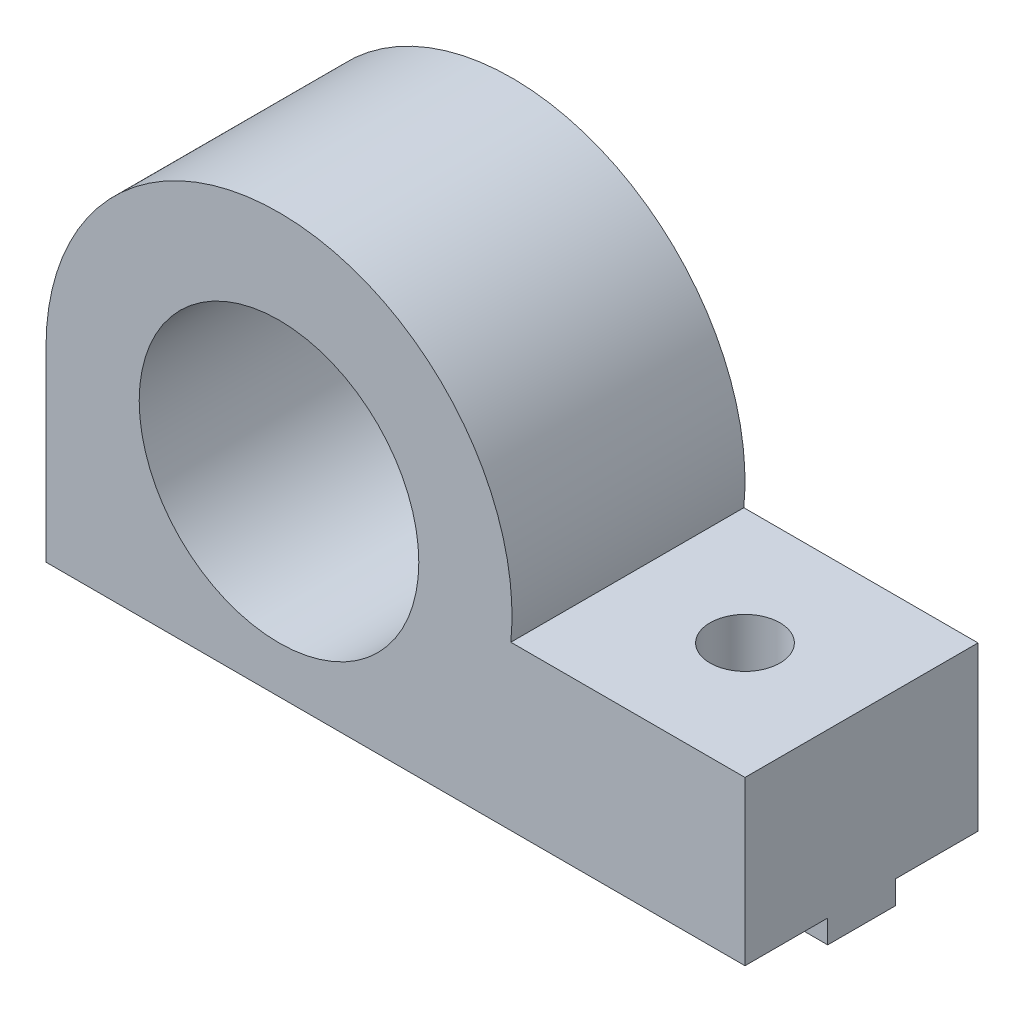
ISO-10303-21;
HEADER;
FILE_DESCRIPTION(('STEP AP214'),'2;1');
FILE_NAME('part.step','',(''),(''),'','','');
FILE_SCHEMA(('AUTOMOTIVE_DESIGN { 1 0 10303 214 1 1 1 1 }'));
ENDSEC;
DATA;
#1=APPLICATION_CONTEXT('core data for automotive mechanical design processes');
#2=APPLICATION_PROTOCOL_DEFINITION('international standard','automotive_design',2000,#1);
#3=PRODUCT_CONTEXT('',#1,'mechanical');
#4=PRODUCT('Part','Part','',(#3));
#5=PRODUCT_RELATED_PRODUCT_CATEGORY('part','',(#4));
#6=PRODUCT_DEFINITION_FORMATION('','',#4);
#7=PRODUCT_DEFINITION_CONTEXT('part definition',#1,'design');
#8=PRODUCT_DEFINITION('design','',#6,#7);
#9=PRODUCT_DEFINITION_SHAPE('','',#8);
#10=(LENGTH_UNIT() NAMED_UNIT(*) SI_UNIT(.MILLI.,.METRE.));
#11=(NAMED_UNIT(*) PLANE_ANGLE_UNIT() SI_UNIT($,.RADIAN.));
#12=(NAMED_UNIT(*) SI_UNIT($,.STERADIAN.) SOLID_ANGLE_UNIT());
#13=UNCERTAINTY_MEASURE_WITH_UNIT(LENGTH_MEASURE(1.E-05),#10,'distance_accuracy_value','');
#14=(GEOMETRIC_REPRESENTATION_CONTEXT(3) GLOBAL_UNCERTAINTY_ASSIGNED_CONTEXT((#13)) GLOBAL_UNIT_ASSIGNED_CONTEXT((#10,
#11,#12)) REPRESENTATION_CONTEXT('',''));
#15=CARTESIAN_POINT('',(0.,0.,0.));
#16=DIRECTION('',(0.,0.,1.));
#17=DIRECTION('',(1.,0.,0.));
#18=AXIS2_PLACEMENT_3D('',#15,#16,#17);
#19=CARTESIAN_POINT('',(-10.,-9.,3.55));
#20=DIRECTION('',(0.,0.,1.));
#21=DIRECTION('',(1.,0.,0.));
#22=AXIS2_PLACEMENT_3D('',#19,#20,#21);
#23=PLANE('',#22);
#24=DIRECTION('',(1.,0.,0.));
#25=VECTOR('',#24,1.);
#26=CARTESIAN_POINT('',(-10.,-9.,3.55));
#27=LINE('',#26,#25);
#28=CARTESIAN_POINT('',(15.3840572873934,-9.,3.55));
#29=VERTEX_POINT('',#28);
#30=CARTESIAN_POINT('',(20.,-9.,3.55));
#31=VERTEX_POINT('',#30);
#32=EDGE_CURVE('E231',#29,#31,#27,.T.);
#33=ORIENTED_EDGE('',*,*,#32,.F.);
#34=DIRECTION('',(0.,1.,0.));
#35=VECTOR('',#34,1.);
#36=CARTESIAN_POINT('',(15.3840572873934,-9.,3.55));
#37=LINE('',#36,#35);
#38=CARTESIAN_POINT('',(15.3840572873934,-8.,3.55));
#39=VERTEX_POINT('',#38);
#40=EDGE_CURVE('E131',#29,#39,#37,.T.);
#41=ORIENTED_EDGE('',*,*,#40,.T.);
#42=DIRECTION('',(1.,0.,0.));
#43=VECTOR('',#42,1.);
#44=CARTESIAN_POINT('',(-10.,-8.,3.55));
#45=LINE('',#44,#43);
#46=CARTESIAN_POINT('',(20.,-8.,3.55));
#47=VERTEX_POINT('',#46);
#48=EDGE_CURVE('E160',#39,#47,#45,.T.);
#49=ORIENTED_EDGE('',*,*,#48,.T.);
#50=DIRECTION('',(0.,1.,0.));
#51=VECTOR('',#50,1.);
#52=CARTESIAN_POINT('',(20.,-9.,3.55));
#53=LINE('',#52,#51);
#54=EDGE_CURVE('E164',#31,#47,#53,.T.);
#55=ORIENTED_EDGE('',*,*,#54,.F.);
#56=EDGE_LOOP('',(#33,#41,#49,#55));
#57=FACE_BOUND('',#56,.T.);
#58=ADVANCED_FACE('F33',(#57),#23,.F.);
#59=CARTESIAN_POINT('',(-10.,-9.,6.45));
#60=DIRECTION('',(0.,0.,-1.));
#61=DIRECTION('',(-1.,0.,0.));
#62=AXIS2_PLACEMENT_3D('',#59,#60,#61);
#63=PLANE('',#62);
#64=DIRECTION('',(-1.,0.,0.));
#65=VECTOR('',#64,1.);
#66=CARTESIAN_POINT('',(-10.,-9.,6.45));
#67=LINE('',#66,#65);
#68=CARTESIAN_POINT('',(14.6159427126066,-9.,6.45));
#69=VERTEX_POINT('',#68);
#70=CARTESIAN_POINT('',(-10.,-9.,6.45));
#71=VERTEX_POINT('',#70);
#72=EDGE_CURVE('E150',#69,#71,#67,.T.);
#73=ORIENTED_EDGE('',*,*,#72,.F.);
#74=DIRECTION('',(0.,1.,0.));
#75=VECTOR('',#74,1.);
#76=CARTESIAN_POINT('',(14.6159427126066,-9.,6.45));
#77=LINE('',#76,#75);
#78=CARTESIAN_POINT('',(14.6159427126066,-8.,6.45));
#79=VERTEX_POINT('',#78);
#80=EDGE_CURVE('E48',#69,#79,#77,.T.);
#81=ORIENTED_EDGE('',*,*,#80,.T.);
#82=DIRECTION('',(-1.,0.,0.));
#83=VECTOR('',#82,1.);
#84=CARTESIAN_POINT('',(-10.,-8.,6.45));
#85=LINE('',#84,#83);
#86=CARTESIAN_POINT('',(-10.,-8.,6.45));
#87=VERTEX_POINT('',#86);
#88=EDGE_CURVE('E159',#79,#87,#85,.T.);
#89=ORIENTED_EDGE('',*,*,#88,.T.);
#90=DIRECTION('',(0.,1.,0.));
#91=VECTOR('',#90,1.);
#92=CARTESIAN_POINT('',(-10.,-9.,6.45));
#93=LINE('',#92,#91);
#94=EDGE_CURVE('E149',#71,#87,#93,.T.);
#95=ORIENTED_EDGE('',*,*,#94,.F.);
#96=EDGE_LOOP('',(#73,#81,#89,#95));
#97=FACE_BOUND('',#96,.T.);
#98=ADVANCED_FACE('F273',(#97),#63,.F.);
#99=CARTESIAN_POINT('',(0.,-9.,0.));
#100=DIRECTION('',(0.,-1.,0.));
#101=DIRECTION('',(0.,0.,-1.));
#102=AXIS2_PLACEMENT_3D('',#99,#100,#101);
#103=PLANE('',#102);
#104=CARTESIAN_POINT('',(15.,-9.,5.));
#105=DIRECTION('',(0.,-1.,0.));
#106=DIRECTION('',(0.,0.,-1.));
#107=AXIS2_PLACEMENT_3D('',#104,#105,#106);
#108=CIRCLE('',#107,1.5);
#109=CARTESIAN_POINT('',(15.3840572873934,-9.,6.45));
#110=VERTEX_POINT('',#109);
#111=EDGE_CURVE('E11',#29,#110,#108,.T.);
#112=ORIENTED_EDGE('',*,*,#111,.F.);
#113=ORIENTED_EDGE('',*,*,#32,.T.);
#114=DIRECTION('',(0.,0.,1.));
#115=VECTOR('',#114,1.);
#116=CARTESIAN_POINT('',(20.,-9.,6.45));
#117=LINE('',#116,#115);
#118=CARTESIAN_POINT('',(20.,-9.,6.45));
#119=VERTEX_POINT('',#118);
#120=EDGE_CURVE('E147',#31,#119,#117,.T.);
#121=ORIENTED_EDGE('',*,*,#120,.T.);
#122=EDGE_CURVE('E140',#119,#110,#67,.T.);
#123=ORIENTED_EDGE('',*,*,#122,.T.);
#124=EDGE_LOOP('',(#112,#113,#121,#123));
#125=FACE_BOUND('',#124,.T.);
#126=ADVANCED_FACE('F145',(#125),#103,.T.);
#127=CARTESIAN_POINT('',(-10.,-8.,10.));
#128=DIRECTION('',(0.,1.,0.));
#129=DIRECTION('',(0.,0.,1.));
#130=AXIS2_PLACEMENT_3D('',#127,#128,#129);
#131=PLANE('',#130);
#132=ORIENTED_EDGE('',*,*,#88,.F.);
#133=CARTESIAN_POINT('',(15.,-8.,5.));
#134=DIRECTION('',(0.,1.,0.));
#135=DIRECTION('',(0.,0.,1.));
#136=AXIS2_PLACEMENT_3D('',#133,#134,#135);
#137=CIRCLE('',#136,1.5);
#138=CARTESIAN_POINT('',(15.3840572873934,-8.,6.45));
#139=VERTEX_POINT('',#138);
#140=EDGE_CURVE('E142',#79,#139,#137,.T.);
#141=ORIENTED_EDGE('',*,*,#140,.T.);
#142=CARTESIAN_POINT('',(20.,-8.,6.45));
#143=VERTEX_POINT('',#142);
#144=EDGE_CURVE('E141',#143,#139,#85,.T.);
#145=ORIENTED_EDGE('',*,*,#144,.F.);
#146=DIRECTION('',(0.,0.,-1.));
#147=VECTOR('',#146,1.);
#148=CARTESIAN_POINT('',(20.,-8.,10.));
#149=LINE('',#148,#147);
#150=CARTESIAN_POINT('',(20.,-8.,10.));
#151=VERTEX_POINT('',#150);
#152=EDGE_CURVE('E204',#151,#143,#149,.T.);
#153=ORIENTED_EDGE('',*,*,#152,.F.);
#154=DIRECTION('',(1.,0.,0.));
#155=VECTOR('',#154,1.);
#156=CARTESIAN_POINT('',(-10.,-8.,10.));
#157=LINE('',#156,#155);
#158=CARTESIAN_POINT('',(-10.,-8.,10.));
#159=VERTEX_POINT('',#158);
#160=EDGE_CURVE('E185',#159,#151,#157,.T.);
#161=ORIENTED_EDGE('',*,*,#160,.F.);
#162=DIRECTION('',(0.,0.,-1.));
#163=VECTOR('',#162,1.);
#164=CARTESIAN_POINT('',(-10.,-8.,10.));
#165=LINE('',#164,#163);
#166=EDGE_CURVE('E208',#159,#87,#165,.T.);
#167=ORIENTED_EDGE('',*,*,#166,.T.);
#168=EDGE_LOOP('',(#132,#141,#145,#153,#161,#167));
#169=FACE_BOUND('',#168,.T.);
#170=ADVANCED_FACE('F276',(#169),#131,.F.);
#171=ORIENTED_EDGE('',*,*,#48,.F.);
#172=CARTESIAN_POINT('',(15.,-8.,5.));
#173=DIRECTION('',(0.,1.,0.));
#174=DIRECTION('',(0.,0.,1.));
#175=AXIS2_PLACEMENT_3D('',#172,#173,#174);
#176=CIRCLE('',#175,1.5);
#177=CARTESIAN_POINT('',(14.6159427126066,-8.,3.55));
#178=VERTEX_POINT('',#177);
#179=EDGE_CURVE('E226',#39,#178,#176,.T.);
#180=ORIENTED_EDGE('',*,*,#179,.T.);
#181=CARTESIAN_POINT('',(-10.,-8.,3.55));
#182=VERTEX_POINT('',#181);
#183=EDGE_CURVE('E56',#182,#178,#45,.T.);
#184=ORIENTED_EDGE('',*,*,#183,.F.);
#185=CARTESIAN_POINT('',(-10.,-8.,0.));
#186=VERTEX_POINT('',#185);
#187=EDGE_CURVE('E207',#182,#186,#165,.T.);
#188=ORIENTED_EDGE('',*,*,#187,.T.);
#189=DIRECTION('',(1.,0.,0.));
#190=VECTOR('',#189,1.);
#191=CARTESIAN_POINT('',(-10.,-8.,0.));
#192=LINE('',#191,#190);
#193=CARTESIAN_POINT('',(20.,-8.,0.));
#194=VERTEX_POINT('',#193);
#195=EDGE_CURVE('E197',#186,#194,#192,.T.);
#196=ORIENTED_EDGE('',*,*,#195,.T.);
#197=EDGE_CURVE('E203',#47,#194,#149,.T.);
#198=ORIENTED_EDGE('',*,*,#197,.F.);
#199=EDGE_LOOP('',(#171,#180,#184,#188,#196,#198));
#200=FACE_BOUND('',#199,.T.);
#201=ADVANCED_FACE('F270',(#200),#131,.F.);
#202=CARTESIAN_POINT('',(0.,0.,10.));
#203=DIRECTION('',(0.,0.,-1.));
#204=DIRECTION('',(-1.,0.,0.));
#205=AXIS2_PLACEMENT_3D('',#202,#203,#204);
#206=PLANE('',#205);
#207=DIRECTION('',(-1.,0.,0.));
#208=VECTOR('',#207,1.);
#209=CARTESIAN_POINT('',(20.,-1.,10.));
#210=LINE('',#209,#208);
#211=CARTESIAN_POINT('',(20.,-1.,10.));
#212=VERTEX_POINT('',#211);
#213=CARTESIAN_POINT('',(9.9498743710662,-0.999999999999998,10.));
#214=VERTEX_POINT('',#213);
#215=EDGE_CURVE('E177',#212,#214,#210,.T.);
#216=ORIENTED_EDGE('',*,*,#215,.T.);
#217=CARTESIAN_POINT('',(0.,0.,10.));
#218=DIRECTION('',(0.,0.,1.));
#219=DIRECTION('',(-1.,0.,0.));
#220=AXIS2_PLACEMENT_3D('',#217,#218,#219);
#221=CIRCLE('',#220,10.);
#222=CARTESIAN_POINT('',(-10.,0.,10.));
#223=VERTEX_POINT('',#222);
#224=EDGE_CURVE('E180',#214,#223,#221,.T.);
#225=ORIENTED_EDGE('',*,*,#224,.T.);
#226=DIRECTION('',(0.,-1.,0.));
#227=VECTOR('',#226,1.);
#228=CARTESIAN_POINT('',(-10.,0.,10.));
#229=LINE('',#228,#227);
#230=EDGE_CURVE('E183',#223,#159,#229,.T.);
#231=ORIENTED_EDGE('',*,*,#230,.T.);
#232=ORIENTED_EDGE('',*,*,#160,.T.);
#233=DIRECTION('',(0.,1.,0.));
#234=VECTOR('',#233,1.);
#235=CARTESIAN_POINT('',(20.,-8.,10.));
#236=LINE('',#235,#234);
#237=EDGE_CURVE('E187',#151,#212,#236,.T.);
#238=ORIENTED_EDGE('',*,*,#237,.T.);
#239=EDGE_LOOP('',(#216,#225,#231,#232,#238));
#240=FACE_BOUND('',#239,.T.);
#241=CARTESIAN_POINT('',(0.,0.,10.));
#242=DIRECTION('',(0.,0.,1.));
#243=DIRECTION('',(1.,0.,0.));
#244=AXIS2_PLACEMENT_3D('',#241,#242,#243);
#245=CIRCLE('',#244,6.);
#246=CARTESIAN_POINT('',(6.,0.,10.));
#247=VERTEX_POINT('',#246);
#248=EDGE_CURVE('E171',#247,#247,#245,.T.);
#249=ORIENTED_EDGE('',*,*,#248,.F.);
#250=EDGE_LOOP('',(#249));
#251=FACE_BOUND('',#250,.T.);
#252=ADVANCED_FACE('F261',(#240,#251),#206,.F.);
#253=CARTESIAN_POINT('',(0.,0.,0.));
#254=DIRECTION('',(0.,0.,-1.));
#255=DIRECTION('',(-1.,0.,0.));
#256=AXIS2_PLACEMENT_3D('',#253,#254,#255);
#257=PLANE('',#256);
#258=DIRECTION('',(-1.,0.,0.));
#259=VECTOR('',#258,1.);
#260=CARTESIAN_POINT('',(20.,-1.,0.));
#261=LINE('',#260,#259);
#262=CARTESIAN_POINT('',(20.,-1.,0.));
#263=VERTEX_POINT('',#262);
#264=CARTESIAN_POINT('',(9.9498743710662,-0.999999999999998,0.));
#265=VERTEX_POINT('',#264);
#266=EDGE_CURVE('E174',#263,#265,#261,.T.);
#267=ORIENTED_EDGE('',*,*,#266,.F.);
#268=DIRECTION('',(0.,1.,0.));
#269=VECTOR('',#268,1.);
#270=CARTESIAN_POINT('',(20.,-8.,0.));
#271=LINE('',#270,#269);
#272=EDGE_CURVE('E181',#194,#263,#271,.T.);
#273=ORIENTED_EDGE('',*,*,#272,.F.);
#274=ORIENTED_EDGE('',*,*,#195,.F.);
#275=DIRECTION('',(0.,-1.,0.));
#276=VECTOR('',#275,1.);
#277=CARTESIAN_POINT('',(-10.,0.,0.));
#278=LINE('',#277,#276);
#279=CARTESIAN_POINT('',(-10.,0.,0.));
#280=VERTEX_POINT('',#279);
#281=EDGE_CURVE('E194',#280,#186,#278,.T.);
#282=ORIENTED_EDGE('',*,*,#281,.F.);
#283=CARTESIAN_POINT('',(0.,0.,0.));
#284=DIRECTION('',(0.,0.,1.));
#285=DIRECTION('',(-1.,0.,0.));
#286=AXIS2_PLACEMENT_3D('',#283,#284,#285);
#287=CIRCLE('',#286,10.);
#288=EDGE_CURVE('E192',#265,#280,#287,.T.);
#289=ORIENTED_EDGE('',*,*,#288,.F.);
#290=EDGE_LOOP('',(#267,#273,#274,#282,#289));
#291=FACE_BOUND('',#290,.T.);
#292=CARTESIAN_POINT('',(0.,0.,0.));
#293=DIRECTION('',(0.,0.,1.));
#294=DIRECTION('',(1.,0.,0.));
#295=AXIS2_PLACEMENT_3D('',#292,#293,#294);
#296=CIRCLE('',#295,6.);
#297=CARTESIAN_POINT('',(6.,0.,0.));
#298=VERTEX_POINT('',#297);
#299=EDGE_CURVE('E170',#298,#298,#296,.T.);
#300=ORIENTED_EDGE('',*,*,#299,.T.);
#301=EDGE_LOOP('',(#300));
#302=FACE_BOUND('',#301,.T.);
#303=ADVANCED_FACE('F245',(#291,#302),#257,.T.);
#304=CARTESIAN_POINT('',(20.,-1.,10.));
#305=DIRECTION('',(0.,-1.,0.));
#306=DIRECTION('',(1.,0.,0.));
#307=AXIS2_PLACEMENT_3D('',#304,#305,#306);
#308=PLANE('',#307);
#309=CARTESIAN_POINT('',(15.,-1.,5.));
#310=DIRECTION('',(0.,1.,0.));
#311=DIRECTION('',(-1.,0.,0.));
#312=AXIS2_PLACEMENT_3D('',#309,#310,#311);
#313=CIRCLE('',#312,1.5);
#314=CARTESIAN_POINT('',(13.5,-1.,5.));
#315=VERTEX_POINT('',#314);
#316=EDGE_CURVE('E143',#315,#315,#313,.T.);
#317=ORIENTED_EDGE('',*,*,#316,.F.);
#318=EDGE_LOOP('',(#317));
#319=FACE_BOUND('',#318,.T.);
#320=ORIENTED_EDGE('',*,*,#266,.T.);
#321=DIRECTION('',(0.,0.,-1.));
#322=VECTOR('',#321,1.);
#323=CARTESIAN_POINT('',(9.9498743710662,-0.999999999999998,10.));
#324=LINE('',#323,#322);
#325=EDGE_CURVE('E213',#214,#265,#324,.T.);
#326=ORIENTED_EDGE('',*,*,#325,.F.);
#327=ORIENTED_EDGE('',*,*,#215,.F.);
#328=DIRECTION('',(0.,0.,-1.));
#329=VECTOR('',#328,1.);
#330=CARTESIAN_POINT('',(20.,-1.,10.));
#331=LINE('',#330,#329);
#332=EDGE_CURVE('E189',#212,#263,#331,.T.);
#333=ORIENTED_EDGE('',*,*,#332,.T.);
#334=EDGE_LOOP('',(#320,#326,#327,#333));
#335=FACE_BOUND('',#334,.T.);
#336=ADVANCED_FACE('F35',(#319,#335),#308,.F.);
#337=CARTESIAN_POINT('',(0.,0.,10.));
#338=DIRECTION('',(0.,0.,-1.));
#339=DIRECTION('',(-1.,0.,0.));
#340=AXIS2_PLACEMENT_3D('',#337,#338,#339);
#341=CYLINDRICAL_SURFACE('',#340,10.);
#342=ORIENTED_EDGE('',*,*,#288,.T.);
#343=DIRECTION('',(0.,0.,-1.));
#344=VECTOR('',#343,1.);
#345=CARTESIAN_POINT('',(-10.,0.,10.));
#346=LINE('',#345,#344);
#347=EDGE_CURVE('E211',#223,#280,#346,.T.);
#348=ORIENTED_EDGE('',*,*,#347,.F.);
#349=ORIENTED_EDGE('',*,*,#224,.F.);
#350=ORIENTED_EDGE('',*,*,#325,.T.);
#351=EDGE_LOOP('',(#342,#348,#349,#350));
#352=FACE_BOUND('',#351,.T.);
#353=ADVANCED_FACE('F244',(#352),#341,.T.);
#354=CARTESIAN_POINT('',(-10.,0.,10.));
#355=DIRECTION('',(1.,0.,0.));
#356=DIRECTION('',(0.,1.,0.));
#357=AXIS2_PLACEMENT_3D('',#354,#355,#356);
#358=PLANE('',#357);
#359=ORIENTED_EDGE('',*,*,#281,.T.);
#360=ORIENTED_EDGE('',*,*,#187,.F.);
#361=DIRECTION('',(0.,1.,0.));
#362=VECTOR('',#361,1.);
#363=CARTESIAN_POINT('',(-10.,-9.,3.55));
#364=LINE('',#363,#362);
#365=CARTESIAN_POINT('',(-10.,-9.,3.55));
#366=VERTEX_POINT('',#365);
#367=EDGE_CURVE('E167',#366,#182,#364,.T.);
#368=ORIENTED_EDGE('',*,*,#367,.F.);
#369=DIRECTION('',(0.,0.,-1.));
#370=VECTOR('',#369,1.);
#371=CARTESIAN_POINT('',(-10.,-9.,6.45));
#372=LINE('',#371,#370);
#373=EDGE_CURVE('E161',#71,#366,#372,.T.);
#374=ORIENTED_EDGE('',*,*,#373,.F.);
#375=ORIENTED_EDGE('',*,*,#94,.T.);
#376=ORIENTED_EDGE('',*,*,#166,.F.);
#377=ORIENTED_EDGE('',*,*,#230,.F.);
#378=ORIENTED_EDGE('',*,*,#347,.T.);
#379=EDGE_LOOP('',(#359,#360,#368,#374,#375,#376,#377,#378));
#380=FACE_BOUND('',#379,.T.);
#381=ADVANCED_FACE('F257',(#380),#358,.F.);
#382=CARTESIAN_POINT('',(20.,-8.,10.));
#383=DIRECTION('',(-1.,0.,0.));
#384=DIRECTION('',(0.,0.,1.));
#385=AXIS2_PLACEMENT_3D('',#382,#383,#384);
#386=PLANE('',#385);
#387=ORIENTED_EDGE('',*,*,#272,.T.);
#388=ORIENTED_EDGE('',*,*,#332,.F.);
#389=ORIENTED_EDGE('',*,*,#237,.F.);
#390=ORIENTED_EDGE('',*,*,#152,.T.);
#391=DIRECTION('',(0.,1.,0.));
#392=VECTOR('',#391,1.);
#393=CARTESIAN_POINT('',(20.,-9.,6.45));
#394=LINE('',#393,#392);
#395=EDGE_CURVE('E153',#119,#143,#394,.T.);
#396=ORIENTED_EDGE('',*,*,#395,.F.);
#397=ORIENTED_EDGE('',*,*,#120,.F.);
#398=ORIENTED_EDGE('',*,*,#54,.T.);
#399=ORIENTED_EDGE('',*,*,#197,.T.);
#400=EDGE_LOOP('',(#387,#388,#389,#390,#396,#397,#398,#399));
#401=FACE_BOUND('',#400,.T.);
#402=ADVANCED_FACE('F266',(#401),#386,.F.);
#403=CARTESIAN_POINT('',(0.,0.,10.));
#404=DIRECTION('',(0.,0.,-1.));
#405=DIRECTION('',(-1.,0.,0.));
#406=AXIS2_PLACEMENT_3D('',#403,#404,#405);
#407=CYLINDRICAL_SURFACE('',#406,6.);
#408=ORIENTED_EDGE('',*,*,#248,.T.);
#409=EDGE_LOOP('',(#408));
#410=FACE_BOUND('',#409,.T.);
#411=ORIENTED_EDGE('',*,*,#299,.F.);
#412=EDGE_LOOP('',(#411));
#413=FACE_BOUND('',#412,.T.);
#414=ADVANCED_FACE('F296',(#410,#413),#407,.F.);
#415=ORIENTED_EDGE('',*,*,#183,.T.);
#416=DIRECTION('',(0.,1.,0.));
#417=VECTOR('',#416,1.);
#418=CARTESIAN_POINT('',(14.6159427126066,-9.,3.55));
#419=LINE('',#418,#417);
#420=CARTESIAN_POINT('',(14.6159427126066,-9.,3.55));
#421=VERTEX_POINT('',#420);
#422=EDGE_CURVE('E218',#178,#421,#419,.F.);
#423=ORIENTED_EDGE('',*,*,#422,.T.);
#424=EDGE_CURVE('E224',#366,#421,#27,.T.);
#425=ORIENTED_EDGE('',*,*,#424,.F.);
#426=ORIENTED_EDGE('',*,*,#367,.T.);
#427=EDGE_LOOP('',(#415,#423,#425,#426));
#428=FACE_BOUND('',#427,.T.);
#429=ADVANCED_FACE('F223',(#428),#23,.F.);
#430=ORIENTED_EDGE('',*,*,#144,.T.);
#431=DIRECTION('',(0.,1.,0.));
#432=VECTOR('',#431,1.);
#433=CARTESIAN_POINT('',(15.3840572873934,-9.,6.45));
#434=LINE('',#433,#432);
#435=EDGE_CURVE('E128',#139,#110,#434,.F.);
#436=ORIENTED_EDGE('',*,*,#435,.T.);
#437=ORIENTED_EDGE('',*,*,#122,.F.);
#438=ORIENTED_EDGE('',*,*,#395,.T.);
#439=EDGE_LOOP('',(#430,#436,#437,#438));
#440=FACE_BOUND('',#439,.T.);
#441=ADVANCED_FACE('F138',(#440),#63,.F.);
#442=EDGE_CURVE('E37',#69,#421,#108,.T.);
#443=ORIENTED_EDGE('',*,*,#442,.F.);
#444=ORIENTED_EDGE('',*,*,#72,.T.);
#445=ORIENTED_EDGE('',*,*,#373,.T.);
#446=ORIENTED_EDGE('',*,*,#424,.T.);
#447=EDGE_LOOP('',(#443,#444,#445,#446));
#448=FACE_BOUND('',#447,.T.);
#449=ADVANCED_FACE('F228',(#448),#103,.T.);
#450=CARTESIAN_POINT('',(15.,-9.,5.));
#451=DIRECTION('',(0.,1.,0.));
#452=DIRECTION('',(-1.,0.,0.));
#453=AXIS2_PLACEMENT_3D('',#450,#451,#452);
#454=CYLINDRICAL_SURFACE('',#453,1.5);
#455=ORIENTED_EDGE('',*,*,#316,.T.);
#456=EDGE_LOOP('',(#455));
#457=FACE_BOUND('',#456,.T.);
#458=ORIENTED_EDGE('',*,*,#111,.T.);
#459=ORIENTED_EDGE('',*,*,#435,.F.);
#460=ORIENTED_EDGE('',*,*,#140,.F.);
#461=ORIENTED_EDGE('',*,*,#80,.F.);
#462=ORIENTED_EDGE('',*,*,#442,.T.);
#463=ORIENTED_EDGE('',*,*,#422,.F.);
#464=ORIENTED_EDGE('',*,*,#179,.F.);
#465=ORIENTED_EDGE('',*,*,#40,.F.);
#466=EDGE_LOOP('',(#458,#459,#460,#461,#462,#463,#464,#465));
#467=FACE_BOUND('',#466,.T.);
#468=ADVANCED_FACE('F127',(#457,#467),#454,.F.);
#469=CLOSED_SHELL('',(#58,#98,#126,#170,#201,#252,#303,#336,#353,#381,#402,#414,#429,#441,#449,#468));
#470=MANIFOLD_SOLID_BREP('B2',#469);
#471=ADVANCED_BREP_SHAPE_REPRESENTATION('',(#18,#470),#14);
#472=SHAPE_DEFINITION_REPRESENTATION(#9,#471);
ENDSEC;
END-ISO-10303-21;
